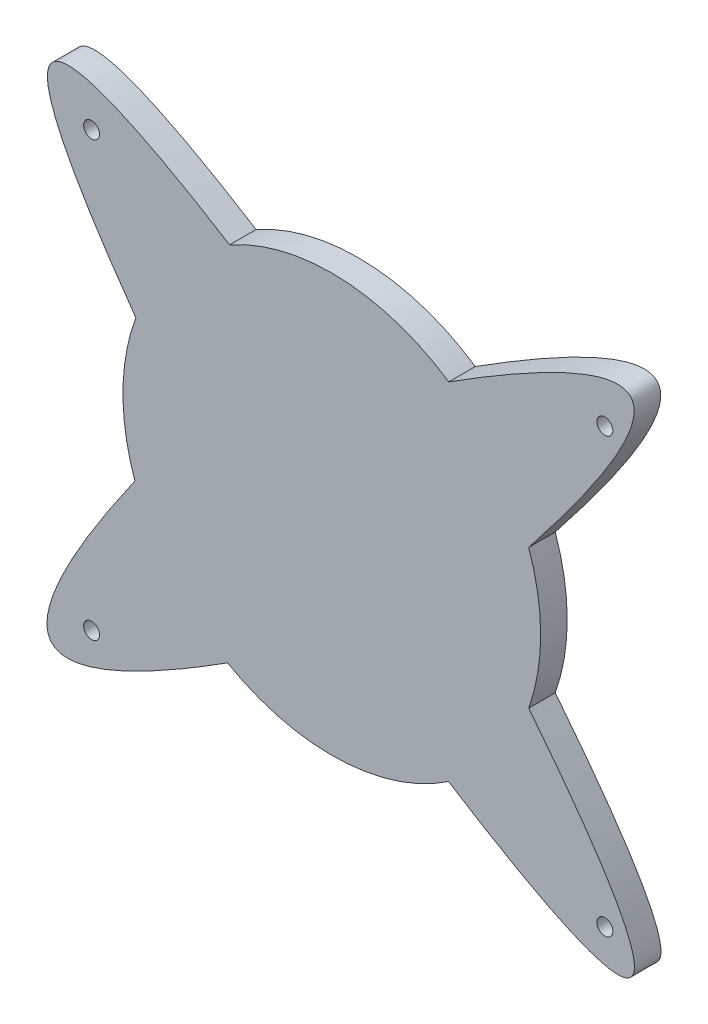
ISO-10303-21;
HEADER;
FILE_DESCRIPTION(('STEP AP214'),'2;1');
FILE_NAME('part.step','',(''),(''),'','','');
FILE_SCHEMA(('AUTOMOTIVE_DESIGN { 1 0 10303 214 1 1 1 1 }'));
ENDSEC;
DATA;
#1=APPLICATION_CONTEXT('core data for automotive mechanical design processes');
#2=APPLICATION_PROTOCOL_DEFINITION('international standard','automotive_design',2000,#1);
#3=PRODUCT_CONTEXT('',#1,'mechanical');
#4=PRODUCT('Part','Part','',(#3));
#5=PRODUCT_RELATED_PRODUCT_CATEGORY('part','',(#4));
#6=PRODUCT_DEFINITION_FORMATION('','',#4);
#7=PRODUCT_DEFINITION_CONTEXT('part definition',#1,'design');
#8=PRODUCT_DEFINITION('design','',#6,#7);
#9=PRODUCT_DEFINITION_SHAPE('','',#8);
#10=(LENGTH_UNIT() NAMED_UNIT(*) SI_UNIT(.MILLI.,.METRE.));
#11=(NAMED_UNIT(*) PLANE_ANGLE_UNIT() SI_UNIT($,.RADIAN.));
#12=(NAMED_UNIT(*) SI_UNIT($,.STERADIAN.) SOLID_ANGLE_UNIT());
#13=UNCERTAINTY_MEASURE_WITH_UNIT(LENGTH_MEASURE(1.E-05),#10,'distance_accuracy_value','');
#14=(GEOMETRIC_REPRESENTATION_CONTEXT(3) GLOBAL_UNCERTAINTY_ASSIGNED_CONTEXT((#13)) GLOBAL_UNIT_ASSIGNED_CONTEXT((#10,
#11,#12)) REPRESENTATION_CONTEXT('',''));
#15=CARTESIAN_POINT('',(0.,0.,0.));
#16=DIRECTION('',(0.,0.,1.));
#17=DIRECTION('',(1.,0.,0.));
#18=AXIS2_PLACEMENT_3D('',#15,#16,#17);
#19=CARTESIAN_POINT('',(-11.8548302171447,0.449999999999998,3.));
#20=DIRECTION('',(0.,0.,-1.));
#21=DIRECTION('',(-1.,0.,0.));
#22=AXIS2_PLACEMENT_3D('',#19,#20,#21);
#23=CYLINDRICAL_SURFACE('',#22,23.6014899645566);
#24=CARTESIAN_POINT('',(-11.8548302171447,0.449999999999998,0.));
#25=DIRECTION('',(0.,0.,1.));
#26=DIRECTION('',(1.,0.,0.));
#27=AXIS2_PLACEMENT_3D('',#24,#25,#26);
#28=CIRCLE('',#27,23.6014899645566);
#29=CARTESIAN_POINT('',(10.4003016101451,-7.40744461622355,0.));
#30=VERTEX_POINT('',#29);
#31=CARTESIAN_POINT('',(10.3933077044033,8.32722588040014,0.));
#32=VERTEX_POINT('',#31);
#33=EDGE_CURVE('E201',#30,#32,#28,.T.);
#34=ORIENTED_EDGE('',*,*,#33,.T.);
#35=DIRECTION('',(0.,0.,-1.));
#36=VECTOR('',#35,1.);
#37=CARTESIAN_POINT('',(10.3933077044033,8.32722588040014,3.));
#38=LINE('',#37,#36);
#39=CARTESIAN_POINT('',(10.3933077044033,8.32722588040014,3.));
#40=VERTEX_POINT('',#39);
#41=EDGE_CURVE('E11',#40,#32,#38,.T.);
#42=ORIENTED_EDGE('',*,*,#41,.F.);
#43=CARTESIAN_POINT('',(-11.8548302171447,0.449999999999998,3.));
#44=DIRECTION('',(0.,0.,1.));
#45=DIRECTION('',(1.,0.,0.));
#46=AXIS2_PLACEMENT_3D('',#43,#44,#45);
#47=CIRCLE('',#46,23.6014899645566);
#48=CARTESIAN_POINT('',(10.4003016101451,-7.40744461622355,3.));
#49=VERTEX_POINT('',#48);
#50=EDGE_CURVE('E183',#49,#40,#47,.T.);
#51=ORIENTED_EDGE('',*,*,#50,.F.);
#52=DIRECTION('',(0.,0.,-1.));
#53=VECTOR('',#52,1.);
#54=CARTESIAN_POINT('',(10.4003016101451,-7.40744461622355,3.));
#55=LINE('',#54,#53);
#56=EDGE_CURVE('E51',#49,#30,#55,.T.);
#57=ORIENTED_EDGE('',*,*,#56,.T.);
#58=EDGE_LOOP('',(#34,#42,#51,#57));
#59=FACE_BOUND('',#58,.T.);
#60=ADVANCED_FACE('F35',(#59),#23,.T.);
#61=CARTESIAN_POINT('',(10.1633981021931,8.03752108827372,3.));
#62=CARTESIAN_POINT('',(38.3256543672401,43.4765725211966,3.));
#63=CARTESIAN_POINT('',(1.20847568157699,19.909608144009,3.));
#64=B_SPLINE_CURVE_WITH_KNOTS('',2,(#61,#62,#63),.UNSPECIFIED.,.F.,.F.,(3,3),(0.,1.),.UNSPECIFIED.);
#65=DIRECTION('',(0.,0.,-1.));
#66=VECTOR('',#65,1.);
#67=SURFACE_OF_LINEAR_EXTRUSION('',#64,#66);
#68=CARTESIAN_POINT('',(10.1633981021931,8.03752108827372,0.));
#69=CARTESIAN_POINT('',(38.3256543672401,43.4765725211966,0.));
#70=CARTESIAN_POINT('',(1.20847568157699,19.909608144009,0.));
#71=B_SPLINE_CURVE_WITH_KNOTS('',2,(#68,#69,#70),.UNSPECIFIED.,.F.,.F.,(3,3),(0.,1.),.UNSPECIFIED.);
#72=CARTESIAN_POINT('',(1.35944398571421,20.0053901990915,0.));
#73=VERTEX_POINT('',#72);
#74=EDGE_CURVE('E194',#32,#73,#71,.T.);
#75=ORIENTED_EDGE('',*,*,#74,.T.);
#76=DIRECTION('',(0.,0.,-1.));
#77=VECTOR('',#76,1.);
#78=CARTESIAN_POINT('',(1.35944398571421,20.0053901990915,3.));
#79=LINE('',#78,#77);
#80=CARTESIAN_POINT('',(1.35944398571421,20.0053901990915,3.));
#81=VERTEX_POINT('',#80);
#82=EDGE_CURVE('E43',#81,#73,#79,.T.);
#83=ORIENTED_EDGE('',*,*,#82,.F.);
#84=EDGE_CURVE('E90',#40,#81,#64,.T.);
#85=ORIENTED_EDGE('',*,*,#84,.F.);
#86=ORIENTED_EDGE('',*,*,#41,.T.);
#87=EDGE_LOOP('',(#75,#83,#85,#86));
#88=FACE_BOUND('',#87,.T.);
#89=ADVANCED_FACE('F187',(#88),#67,.F.);
#90=CARTESIAN_POINT('',(-11.8548302171447,0.449999999999998,3.));
#91=DIRECTION('',(0.,0.,-1.));
#92=DIRECTION('',(-1.,0.,0.));
#93=AXIS2_PLACEMENT_3D('',#90,#91,#92);
#94=CYLINDRICAL_SURFACE('',#93,23.6014899645566);
#95=CARTESIAN_POINT('',(-11.8548302171447,0.449999999999998,0.));
#96=DIRECTION('',(0.,0.,1.));
#97=DIRECTION('',(1.,0.,0.));
#98=AXIS2_PLACEMENT_3D('',#95,#96,#97);
#99=CIRCLE('',#98,23.6014899645566);
#100=CARTESIAN_POINT('',(-23.4078091034136,21.0305492492424,0.));
#101=VERTEX_POINT('',#100);
#102=EDGE_CURVE('E200',#73,#101,#99,.T.);
#103=ORIENTED_EDGE('',*,*,#102,.T.);
#104=DIRECTION('',(0.,0.,-1.));
#105=VECTOR('',#104,1.);
#106=CARTESIAN_POINT('',(-23.4078091034136,21.0305492492424,3.));
#107=LINE('',#106,#105);
#108=CARTESIAN_POINT('',(-23.4078091034136,21.0305492492424,3.));
#109=VERTEX_POINT('',#108);
#110=EDGE_CURVE('E206',#109,#101,#107,.T.);
#111=ORIENTED_EDGE('',*,*,#110,.F.);
#112=CARTESIAN_POINT('',(-11.8548302171447,0.449999999999998,3.));
#113=DIRECTION('',(0.,0.,1.));
#114=DIRECTION('',(1.,0.,0.));
#115=AXIS2_PLACEMENT_3D('',#112,#113,#114);
#116=CIRCLE('',#115,23.6014899645566);
#117=EDGE_CURVE('E174',#81,#109,#116,.T.);
#118=ORIENTED_EDGE('',*,*,#117,.F.);
#119=ORIENTED_EDGE('',*,*,#82,.T.);
#120=EDGE_LOOP('',(#103,#111,#118,#119));
#121=FACE_BOUND('',#120,.T.);
#122=ADVANCED_FACE('F166',(#121),#94,.T.);
#123=CARTESIAN_POINT('',(-34.0028513027008,8.60447671778076,3.));
#124=CARTESIAN_POINT('',(-58.3334576067519,42.7585665948256,3.));
#125=CARTESIAN_POINT('',(-23.4078091034136,21.0305492492424,3.));
#126=B_SPLINE_CURVE_WITH_KNOTS('',2,(#123,#124,#125),.UNSPECIFIED.,.F.,.F.,(3,3),(0.,1.),.UNSPECIFIED.);
#127=DIRECTION('',(0.,0.,-1.));
#128=VECTOR('',#127,1.);
#129=SURFACE_OF_LINEAR_EXTRUSION('',#126,#128);
#130=CARTESIAN_POINT('',(-34.0028513027008,8.60447671778076,0.));
#131=CARTESIAN_POINT('',(-58.3334576067519,42.7585665948256,0.));
#132=CARTESIAN_POINT('',(-23.4078091034136,21.0305492492424,0.));
#133=B_SPLINE_CURVE_WITH_KNOTS('',2,(#130,#131,#132),.UNSPECIFIED.,.F.,.F.,(3,3),(0.,1.),.UNSPECIFIED.);
#134=CARTESIAN_POINT('',(-34.0028513027008,8.60447671778076,0.));
#135=VERTEX_POINT('',#134);
#136=EDGE_CURVE('E211',#135,#101,#133,.T.);
#137=ORIENTED_EDGE('',*,*,#136,.F.);
#138=DIRECTION('',(0.,0.,-1.));
#139=VECTOR('',#138,1.);
#140=CARTESIAN_POINT('',(-34.0028513027008,8.60447671778076,3.));
#141=LINE('',#140,#139);
#142=CARTESIAN_POINT('',(-34.0028513027008,8.60447671778076,3.));
#143=VERTEX_POINT('',#142);
#144=EDGE_CURVE('E257',#143,#135,#141,.T.);
#145=ORIENTED_EDGE('',*,*,#144,.F.);
#146=EDGE_CURVE('E168',#143,#109,#126,.T.);
#147=ORIENTED_EDGE('',*,*,#146,.T.);
#148=ORIENTED_EDGE('',*,*,#110,.T.);
#149=EDGE_LOOP('',(#137,#145,#147,#148));
#150=FACE_BOUND('',#149,.T.);
#151=ADVANCED_FACE('F161',(#150),#129,.T.);
#152=CARTESIAN_POINT('',(-11.8548302171447,0.449999999999998,3.));
#153=DIRECTION('',(0.,0.,-1.));
#154=DIRECTION('',(-1.,0.,0.));
#155=AXIS2_PLACEMENT_3D('',#152,#153,#154);
#156=CYLINDRICAL_SURFACE('',#155,23.6014899645566);
#157=CARTESIAN_POINT('',(-11.8548302171447,0.449999999999998,0.));
#158=DIRECTION('',(0.,0.,1.));
#159=DIRECTION('',(1.,0.,0.));
#160=AXIS2_PLACEMENT_3D('',#157,#158,#159);
#161=CIRCLE('',#160,23.6014899645566);
#162=CARTESIAN_POINT('',(-34.1053323053957,-7.42054543013414,0.));
#163=VERTEX_POINT('',#162);
#164=EDGE_CURVE('E213',#135,#163,#161,.T.);
#165=ORIENTED_EDGE('',*,*,#164,.T.);
#166=DIRECTION('',(0.,0.,-1.));
#167=VECTOR('',#166,1.);
#168=CARTESIAN_POINT('',(-34.1053323053957,-7.42054543013414,3.));
#169=LINE('',#168,#167);
#170=CARTESIAN_POINT('',(-34.1053323053957,-7.42054543013414,3.));
#171=VERTEX_POINT('',#170);
#172=EDGE_CURVE('E126',#171,#163,#169,.T.);
#173=ORIENTED_EDGE('',*,*,#172,.F.);
#174=CARTESIAN_POINT('',(-11.8548302171447,0.449999999999998,3.));
#175=DIRECTION('',(0.,0.,1.));
#176=DIRECTION('',(1.,0.,0.));
#177=AXIS2_PLACEMENT_3D('',#174,#175,#176);
#178=CIRCLE('',#177,23.6014899645566);
#179=EDGE_CURVE('E114',#143,#171,#178,.T.);
#180=ORIENTED_EDGE('',*,*,#179,.F.);
#181=ORIENTED_EDGE('',*,*,#144,.T.);
#182=EDGE_LOOP('',(#165,#173,#180,#181));
#183=FACE_BOUND('',#182,.T.);
#184=ADVANCED_FACE('F158',(#183),#156,.T.);
#185=CARTESIAN_POINT('',(-34.1053323053957,-7.42054543013415,3.));
#186=CARTESIAN_POINT('',(-58.281676492555,-42.0509180155043,3.));
#187=CARTESIAN_POINT('',(-23.6427026156871,-19.9969164634365,3.));
#188=B_SPLINE_CURVE_WITH_KNOTS('',2,(#185,#186,#187),.UNSPECIFIED.,.F.,.F.,(3,3),(0.,1.),.UNSPECIFIED.);
#189=DIRECTION('',(0.,0.,-1.));
#190=VECTOR('',#189,1.);
#191=SURFACE_OF_LINEAR_EXTRUSION('',#188,#190);
#192=CARTESIAN_POINT('',(-34.1053323053957,-7.42054543013415,0.));
#193=CARTESIAN_POINT('',(-58.281676492555,-42.0509180155043,0.));
#194=CARTESIAN_POINT('',(-23.6427026156871,-19.9969164634365,0.));
#195=B_SPLINE_CURVE_WITH_KNOTS('',2,(#192,#193,#194),.UNSPECIFIED.,.F.,.F.,(3,3),(0.,1.),.UNSPECIFIED.);
#196=CARTESIAN_POINT('',(-23.6427026156871,-19.9969164634365,0.));
#197=VERTEX_POINT('',#196);
#198=EDGE_CURVE('E123',#163,#197,#195,.T.);
#199=ORIENTED_EDGE('',*,*,#198,.T.);
#200=DIRECTION('',(0.,0.,-1.));
#201=VECTOR('',#200,1.);
#202=CARTESIAN_POINT('',(-23.6427026156871,-19.9969164634365,3.));
#203=LINE('',#202,#201);
#204=CARTESIAN_POINT('',(-23.6427026156871,-19.9969164634365,3.));
#205=VERTEX_POINT('',#204);
#206=EDGE_CURVE('E120',#205,#197,#203,.T.);
#207=ORIENTED_EDGE('',*,*,#206,.F.);
#208=EDGE_CURVE('E105',#171,#205,#188,.T.);
#209=ORIENTED_EDGE('',*,*,#208,.F.);
#210=ORIENTED_EDGE('',*,*,#172,.T.);
#211=EDGE_LOOP('',(#199,#207,#209,#210));
#212=FACE_BOUND('',#211,.T.);
#213=ADVANCED_FACE('F121',(#212),#191,.F.);
#214=CARTESIAN_POINT('',(-11.8548302171447,0.449999999999998,3.));
#215=DIRECTION('',(0.,0.,-1.));
#216=DIRECTION('',(-1.,0.,0.));
#217=AXIS2_PLACEMENT_3D('',#214,#215,#216);
#218=CYLINDRICAL_SURFACE('',#217,23.6014899645566);
#219=CARTESIAN_POINT('',(-11.8548302171447,0.449999999999998,0.));
#220=DIRECTION('',(0.,0.,1.));
#221=DIRECTION('',(1.,0.,0.));
#222=AXIS2_PLACEMENT_3D('',#219,#220,#221);
#223=CIRCLE('',#222,23.6014899645566);
#224=CARTESIAN_POINT('',(1.33361871656908,-19.1228164368313,0.));
#225=VERTEX_POINT('',#224);
#226=EDGE_CURVE('E228',#197,#225,#223,.T.);
#227=ORIENTED_EDGE('',*,*,#226,.T.);
#228=DIRECTION('',(0.,0.,-1.));
#229=VECTOR('',#228,1.);
#230=CARTESIAN_POINT('',(1.33361871656908,-19.1228164368313,3.));
#231=LINE('',#230,#229);
#232=CARTESIAN_POINT('',(1.33361871656908,-19.1228164368313,3.));
#233=VERTEX_POINT('',#232);
#234=EDGE_CURVE('E78',#233,#225,#231,.T.);
#235=ORIENTED_EDGE('',*,*,#234,.F.);
#236=CARTESIAN_POINT('',(-11.8548302171447,0.449999999999998,3.));
#237=DIRECTION('',(0.,0.,1.));
#238=DIRECTION('',(1.,0.,0.));
#239=AXIS2_PLACEMENT_3D('',#236,#237,#238);
#240=CIRCLE('',#239,23.6014899645566);
#241=EDGE_CURVE('E111',#205,#233,#240,.T.);
#242=ORIENTED_EDGE('',*,*,#241,.F.);
#243=ORIENTED_EDGE('',*,*,#206,.T.);
#244=EDGE_LOOP('',(#227,#235,#242,#243));
#245=FACE_BOUND('',#244,.T.);
#246=ADVANCED_FACE('F128',(#245),#218,.T.);
#247=CARTESIAN_POINT('',(19.,-24.5,3.));
#248=DIRECTION('',(0.,0.,-1.));
#249=DIRECTION('',(-1.,0.,0.));
#250=AXIS2_PLACEMENT_3D('',#247,#248,#249);
#251=CYLINDRICAL_SURFACE('',#250,0.900000000000001);
#252=CARTESIAN_POINT('',(19.,-24.5,3.));
#253=DIRECTION('',(0.,0.,1.));
#254=DIRECTION('',(1.,0.,0.));
#255=AXIS2_PLACEMENT_3D('',#252,#253,#254);
#256=CIRCLE('',#255,0.900000000000001);
#257=CARTESIAN_POINT('',(19.9,-24.5,3.));
#258=VERTEX_POINT('',#257);
#259=EDGE_CURVE('E262',#258,#258,#256,.T.);
#260=ORIENTED_EDGE('',*,*,#259,.T.);
#261=EDGE_LOOP('',(#260));
#262=FACE_BOUND('',#261,.T.);
#263=CARTESIAN_POINT('',(19.,-24.5,0.));
#264=DIRECTION('',(0.,0.,1.));
#265=DIRECTION('',(1.,0.,0.));
#266=AXIS2_PLACEMENT_3D('',#263,#264,#265);
#267=CIRCLE('',#266,0.900000000000001);
#268=CARTESIAN_POINT('',(19.9,-24.5,0.));
#269=VERTEX_POINT('',#268);
#270=EDGE_CURVE('E247',#269,#269,#267,.T.);
#271=ORIENTED_EDGE('',*,*,#270,.F.);
#272=EDGE_LOOP('',(#271));
#273=FACE_BOUND('',#272,.T.);
#274=ADVANCED_FACE('F155',(#262,#273),#251,.F.);
#275=CARTESIAN_POINT('',(-39.,-24.5,3.));
#276=DIRECTION('',(0.,0.,-1.));
#277=DIRECTION('',(-1.,0.,0.));
#278=AXIS2_PLACEMENT_3D('',#275,#276,#277);
#279=CYLINDRICAL_SURFACE('',#278,0.899999999999997);
#280=CARTESIAN_POINT('',(-39.,-24.5,3.));
#281=DIRECTION('',(0.,0.,1.));
#282=DIRECTION('',(1.,0.,0.));
#283=AXIS2_PLACEMENT_3D('',#280,#281,#282);
#284=CIRCLE('',#283,0.899999999999997);
#285=CARTESIAN_POINT('',(-38.1,-24.5,3.));
#286=VERTEX_POINT('',#285);
#287=EDGE_CURVE('E264',#286,#286,#284,.T.);
#288=ORIENTED_EDGE('',*,*,#287,.T.);
#289=EDGE_LOOP('',(#288));
#290=FACE_BOUND('',#289,.T.);
#291=CARTESIAN_POINT('',(-39.,-24.5,0.));
#292=DIRECTION('',(0.,0.,1.));
#293=DIRECTION('',(1.,0.,0.));
#294=AXIS2_PLACEMENT_3D('',#291,#292,#293);
#295=CIRCLE('',#294,0.899999999999997);
#296=CARTESIAN_POINT('',(-38.1,-24.5,0.));
#297=VERTEX_POINT('',#296);
#298=EDGE_CURVE('E244',#297,#297,#295,.T.);
#299=ORIENTED_EDGE('',*,*,#298,.F.);
#300=EDGE_LOOP('',(#299));
#301=FACE_BOUND('',#300,.T.);
#302=ADVANCED_FACE('F291',(#290,#301),#279,.F.);
#303=CARTESIAN_POINT('',(-39.,24.5,3.));
#304=DIRECTION('',(0.,0.,-1.));
#305=DIRECTION('',(-1.,0.,0.));
#306=AXIS2_PLACEMENT_3D('',#303,#304,#305);
#307=CYLINDRICAL_SURFACE('',#306,0.899999999999997);
#308=CARTESIAN_POINT('',(-39.,24.5,3.));
#309=DIRECTION('',(0.,0.,1.));
#310=DIRECTION('',(1.,0.,0.));
#311=AXIS2_PLACEMENT_3D('',#308,#309,#310);
#312=CIRCLE('',#311,0.899999999999997);
#313=CARTESIAN_POINT('',(-38.1,24.5,3.));
#314=VERTEX_POINT('',#313);
#315=EDGE_CURVE('E131',#314,#314,#312,.T.);
#316=ORIENTED_EDGE('',*,*,#315,.T.);
#317=EDGE_LOOP('',(#316));
#318=FACE_BOUND('',#317,.T.);
#319=CARTESIAN_POINT('',(-39.,24.5,0.));
#320=DIRECTION('',(0.,0.,1.));
#321=DIRECTION('',(1.,0.,0.));
#322=AXIS2_PLACEMENT_3D('',#319,#320,#321);
#323=CIRCLE('',#322,0.899999999999997);
#324=CARTESIAN_POINT('',(-38.1,24.5,0.));
#325=VERTEX_POINT('',#324);
#326=EDGE_CURVE('E238',#325,#325,#323,.T.);
#327=ORIENTED_EDGE('',*,*,#326,.F.);
#328=EDGE_LOOP('',(#327));
#329=FACE_BOUND('',#328,.T.);
#330=ADVANCED_FACE('F151',(#318,#329),#307,.F.);
#331=CARTESIAN_POINT('',(10.4003016101451,-7.40744461622354,3.));
#332=CARTESIAN_POINT('',(38.1882485639833,-42.4522560011075,3.));
#333=CARTESIAN_POINT('',(1.33361871656909,-19.1228164368312,3.));
#334=B_SPLINE_CURVE_WITH_KNOTS('',2,(#331,#332,#333),.UNSPECIFIED.,.F.,.F.,(3,3),(0.,1.),.UNSPECIFIED.);
#335=DIRECTION('',(0.,0.,-1.));
#336=VECTOR('',#335,1.);
#337=SURFACE_OF_LINEAR_EXTRUSION('',#334,#336);
#338=CARTESIAN_POINT('',(10.4003016101451,-7.40744461622354,0.));
#339=CARTESIAN_POINT('',(38.1882485639833,-42.4522560011075,0.));
#340=CARTESIAN_POINT('',(1.33361871656909,-19.1228164368312,0.));
#341=B_SPLINE_CURVE_WITH_KNOTS('',2,(#338,#339,#340),.UNSPECIFIED.,.F.,.F.,(3,3),(0.,1.),.UNSPECIFIED.);
#342=EDGE_CURVE('E233',#30,#225,#341,.T.);
#343=ORIENTED_EDGE('',*,*,#342,.F.);
#344=ORIENTED_EDGE('',*,*,#56,.F.);
#345=EDGE_CURVE('E129',#49,#233,#334,.T.);
#346=ORIENTED_EDGE('',*,*,#345,.T.);
#347=ORIENTED_EDGE('',*,*,#234,.T.);
#348=EDGE_LOOP('',(#343,#344,#346,#347));
#349=FACE_BOUND('',#348,.T.);
#350=ADVANCED_FACE('F146',(#349),#337,.T.);
#351=CARTESIAN_POINT('',(19.,24.5,3.));
#352=DIRECTION('',(0.,0.,-1.));
#353=DIRECTION('',(-1.,0.,0.));
#354=AXIS2_PLACEMENT_3D('',#351,#352,#353);
#355=CYLINDRICAL_SURFACE('',#354,0.900000000000001);
#356=CARTESIAN_POINT('',(19.,24.5,3.));
#357=DIRECTION('',(0.,0.,1.));
#358=DIRECTION('',(1.,0.,0.));
#359=AXIS2_PLACEMENT_3D('',#356,#357,#358);
#360=CIRCLE('',#359,0.900000000000001);
#361=CARTESIAN_POINT('',(19.9,24.5,3.));
#362=VERTEX_POINT('',#361);
#363=EDGE_CURVE('E254',#362,#362,#360,.T.);
#364=ORIENTED_EDGE('',*,*,#363,.T.);
#365=EDGE_LOOP('',(#364));
#366=FACE_BOUND('',#365,.T.);
#367=CARTESIAN_POINT('',(19.,24.5,0.));
#368=DIRECTION('',(0.,0.,1.));
#369=DIRECTION('',(1.,0.,0.));
#370=AXIS2_PLACEMENT_3D('',#367,#368,#369);
#371=CIRCLE('',#370,0.900000000000001);
#372=CARTESIAN_POINT('',(19.9,24.5,0.));
#373=VERTEX_POINT('',#372);
#374=EDGE_CURVE('E250',#373,#373,#371,.T.);
#375=ORIENTED_EDGE('',*,*,#374,.F.);
#376=EDGE_LOOP('',(#375));
#377=FACE_BOUND('',#376,.T.);
#378=ADVANCED_FACE('F150',(#366,#377),#355,.F.);
#379=CARTESIAN_POINT('',(0.,0.,3.));
#380=DIRECTION('',(0.,0.,1.));
#381=DIRECTION('',(1.,0.,0.));
#382=AXIS2_PLACEMENT_3D('',#379,#380,#381);
#383=PLANE('',#382);
#384=ORIENTED_EDGE('',*,*,#50,.T.);
#385=ORIENTED_EDGE('',*,*,#84,.T.);
#386=ORIENTED_EDGE('',*,*,#117,.T.);
#387=ORIENTED_EDGE('',*,*,#146,.F.);
#388=ORIENTED_EDGE('',*,*,#179,.T.);
#389=ORIENTED_EDGE('',*,*,#208,.T.);
#390=ORIENTED_EDGE('',*,*,#241,.T.);
#391=ORIENTED_EDGE('',*,*,#345,.F.);
#392=EDGE_LOOP('',(#384,#385,#386,#387,#388,#389,#390,#391));
#393=FACE_BOUND('',#392,.T.);
#394=ORIENTED_EDGE('',*,*,#315,.F.);
#395=EDGE_LOOP('',(#394));
#396=FACE_BOUND('',#395,.T.);
#397=ORIENTED_EDGE('',*,*,#287,.F.);
#398=EDGE_LOOP('',(#397));
#399=FACE_BOUND('',#398,.T.);
#400=ORIENTED_EDGE('',*,*,#259,.F.);
#401=EDGE_LOOP('',(#400));
#402=FACE_BOUND('',#401,.T.);
#403=ORIENTED_EDGE('',*,*,#363,.F.);
#404=EDGE_LOOP('',(#403));
#405=FACE_BOUND('',#404,.T.);
#406=ADVANCED_FACE('F107',(#393,#396,#399,#402,#405),#383,.T.);
#407=CARTESIAN_POINT('',(0.,0.,0.));
#408=DIRECTION('',(0.,0.,1.));
#409=DIRECTION('',(1.,0.,0.));
#410=AXIS2_PLACEMENT_3D('',#407,#408,#409);
#411=PLANE('',#410);
#412=ORIENTED_EDGE('',*,*,#33,.F.);
#413=ORIENTED_EDGE('',*,*,#342,.T.);
#414=ORIENTED_EDGE('',*,*,#226,.F.);
#415=ORIENTED_EDGE('',*,*,#198,.F.);
#416=ORIENTED_EDGE('',*,*,#164,.F.);
#417=ORIENTED_EDGE('',*,*,#136,.T.);
#418=ORIENTED_EDGE('',*,*,#102,.F.);
#419=ORIENTED_EDGE('',*,*,#74,.F.);
#420=EDGE_LOOP('',(#412,#413,#414,#415,#416,#417,#418,#419));
#421=FACE_BOUND('',#420,.T.);
#422=ORIENTED_EDGE('',*,*,#326,.T.);
#423=EDGE_LOOP('',(#422));
#424=FACE_BOUND('',#423,.T.);
#425=ORIENTED_EDGE('',*,*,#298,.T.);
#426=EDGE_LOOP('',(#425));
#427=FACE_BOUND('',#426,.T.);
#428=ORIENTED_EDGE('',*,*,#270,.T.);
#429=EDGE_LOOP('',(#428));
#430=FACE_BOUND('',#429,.T.);
#431=ORIENTED_EDGE('',*,*,#374,.T.);
#432=EDGE_LOOP('',(#431));
#433=FACE_BOUND('',#432,.T.);
#434=ADVANCED_FACE('F207',(#421,#424,#427,#430,#433),#411,.F.);
#435=CLOSED_SHELL('',(#60,#89,#122,#151,#184,#213,#246,#274,#302,#330,#350,#378,#406,#434));
#436=MANIFOLD_SOLID_BREP('B2',#435);
#437=ADVANCED_BREP_SHAPE_REPRESENTATION('',(#18,#436),#14);
#438=SHAPE_DEFINITION_REPRESENTATION(#9,#437);
ENDSEC;
END-ISO-10303-21;
